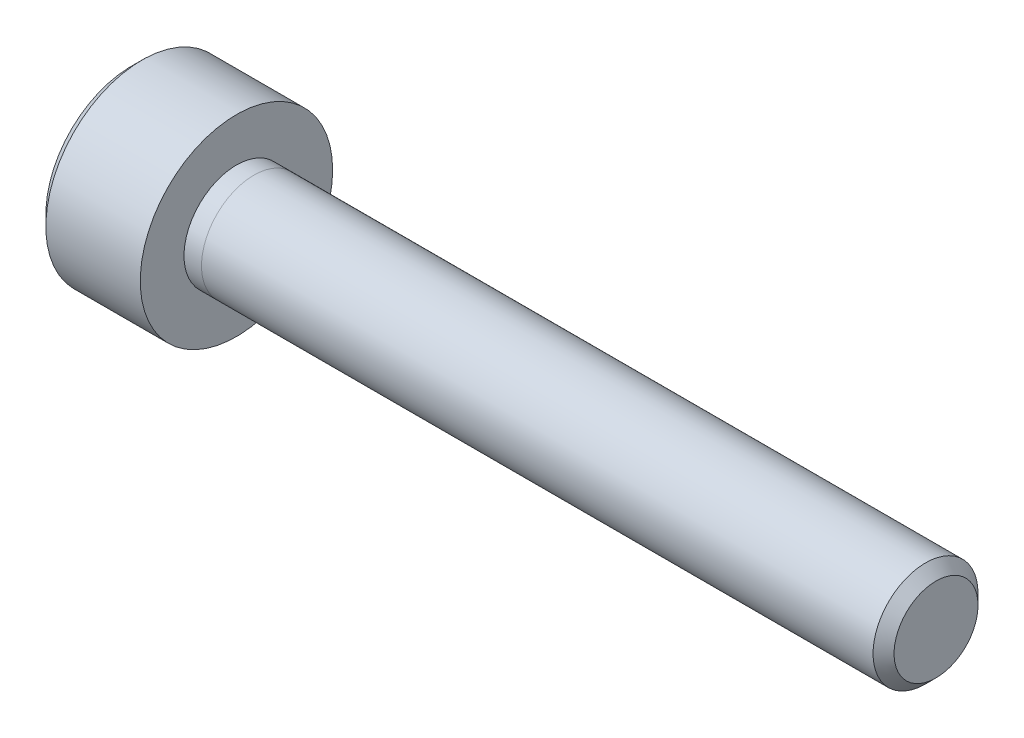
ISO-10303-21;
HEADER;
FILE_DESCRIPTION(('STEP AP214'),'2;1');
FILE_NAME('part.step','',(''),(''),'','','');
FILE_SCHEMA(('AUTOMOTIVE_DESIGN { 1 0 10303 214 1 1 1 1 }'));
ENDSEC;
DATA;
#1=APPLICATION_CONTEXT('core data for automotive mechanical design processes');
#2=APPLICATION_PROTOCOL_DEFINITION('international standard','automotive_design',2000,#1);
#3=PRODUCT_CONTEXT('',#1,'mechanical');
#4=PRODUCT('Part','Part','',(#3));
#5=PRODUCT_RELATED_PRODUCT_CATEGORY('part','',(#4));
#6=PRODUCT_DEFINITION_FORMATION('','',#4);
#7=PRODUCT_DEFINITION_CONTEXT('part definition',#1,'design');
#8=PRODUCT_DEFINITION('design','',#6,#7);
#9=PRODUCT_DEFINITION_SHAPE('','',#8);
#10=(LENGTH_UNIT() NAMED_UNIT(*) SI_UNIT(.MILLI.,.METRE.));
#11=(NAMED_UNIT(*) PLANE_ANGLE_UNIT() SI_UNIT($,.RADIAN.));
#12=(NAMED_UNIT(*) SI_UNIT($,.STERADIAN.) SOLID_ANGLE_UNIT());
#13=UNCERTAINTY_MEASURE_WITH_UNIT(LENGTH_MEASURE(1.E-05),#10,'distance_accuracy_value','');
#14=(GEOMETRIC_REPRESENTATION_CONTEXT(3) GLOBAL_UNCERTAINTY_ASSIGNED_CONTEXT((#13)) GLOBAL_UNIT_ASSIGNED_CONTEXT((#10,
#11,#12)) REPRESENTATION_CONTEXT('',''));
#15=CARTESIAN_POINT('',(0.,0.,0.));
#16=DIRECTION('',(0.,0.,1.));
#17=DIRECTION('',(1.,0.,0.));
#18=AXIS2_PLACEMENT_3D('',#15,#16,#17);
#19=CARTESIAN_POINT('',(23.,0.,0.));
#20=DIRECTION('',(-1.,0.,0.));
#21=DIRECTION('',(0.,0.,1.));
#22=AXIS2_PLACEMENT_3D('',#19,#20,#21);
#23=CYLINDRICAL_SURFACE('',#22,1.5);
#24=CARTESIAN_POINT('',(22.7,0.,0.));
#25=DIRECTION('',(1.,0.,0.));
#26=DIRECTION('',(0.,0.,-1.));
#27=AXIS2_PLACEMENT_3D('',#24,#25,#26);
#28=CIRCLE('',#27,1.5);
#29=CARTESIAN_POINT('',(22.7,0.,-1.5));
#30=VERTEX_POINT('',#29);
#31=EDGE_CURVE('E11',#30,#30,#28,.F.);
#32=ORIENTED_EDGE('',*,*,#31,.T.);
#33=EDGE_LOOP('',(#32));
#34=FACE_BOUND('',#33,.T.);
#35=CARTESIAN_POINT('',(3.5,0.,0.));
#36=DIRECTION('',(1.,0.,0.));
#37=DIRECTION('',(0.,0.,-1.));
#38=AXIS2_PLACEMENT_3D('',#35,#36,#37);
#39=CIRCLE('',#38,1.5);
#40=CARTESIAN_POINT('',(3.5,0.,-1.5));
#41=VERTEX_POINT('',#40);
#42=EDGE_CURVE('E64',#41,#41,#39,.T.);
#43=ORIENTED_EDGE('',*,*,#42,.T.);
#44=EDGE_LOOP('',(#43));
#45=FACE_BOUND('',#44,.T.);
#46=ADVANCED_FACE('F50',(#34,#45),#23,.T.);
#47=CARTESIAN_POINT('',(23.,0.,0.));
#48=DIRECTION('',(1.,0.,0.));
#49=DIRECTION('',(0.,0.,-1.));
#50=AXIS2_PLACEMENT_3D('',#47,#48,#49);
#51=PLANE('',#50);
#52=CARTESIAN_POINT('',(23.,0.,0.));
#53=DIRECTION('',(1.,0.,0.));
#54=DIRECTION('',(0.,0.,-1.));
#55=AXIS2_PLACEMENT_3D('',#52,#53,#54);
#56=CIRCLE('',#55,1.2);
#57=CARTESIAN_POINT('',(23.,0.,-1.2));
#58=VERTEX_POINT('',#57);
#59=EDGE_CURVE('E58',#58,#58,#56,.T.);
#60=ORIENTED_EDGE('',*,*,#59,.T.);
#61=EDGE_LOOP('',(#60));
#62=FACE_BOUND('',#61,.T.);
#63=ADVANCED_FACE('F74',(#62),#51,.T.);
#64=CARTESIAN_POINT('',(3.5,0.,0.));
#65=DIRECTION('',(1.,0.,0.));
#66=DIRECTION('',(0.,0.,-1.));
#67=AXIS2_PLACEMENT_3D('',#64,#65,#66);
#68=PLANE('',#67);
#69=ORIENTED_EDGE('',*,*,#42,.F.);
#70=EDGE_LOOP('',(#69));
#71=FACE_BOUND('',#70,.T.);
#72=ADVANCED_FACE('F72',(#71),#68,.F.);
#73=CARTESIAN_POINT('',(23.,0.,0.));
#74=DIRECTION('',(-1.,0.,0.));
#75=DIRECTION('',(0.,0.,1.));
#76=AXIS2_PLACEMENT_3D('',#73,#74,#75);
#77=CONICAL_SURFACE('',#76,1.2,0.785398163397452);
#78=ORIENTED_EDGE('',*,*,#31,.F.);
#79=EDGE_LOOP('',(#78));
#80=FACE_BOUND('',#79,.T.);
#81=ORIENTED_EDGE('',*,*,#59,.F.);
#82=EDGE_LOOP('',(#81));
#83=FACE_BOUND('',#82,.T.);
#84=ADVANCED_FACE('F52',(#80,#83),#77,.T.);
#85=CLOSED_SHELL('',(#46,#63,#72,#84));
#86=MANIFOLD_SOLID_BREP('B2',#85);
#87=CARTESIAN_POINT('',(3.,0.,0.));
#88=DIRECTION('',(1.,0.,0.));
#89=DIRECTION('',(0.,0.,-1.));
#90=AXIS2_PLACEMENT_3D('',#87,#88,#89);
#91=PLANE('',#90);
#92=CARTESIAN_POINT('',(3.,0.,0.));
#93=DIRECTION('',(1.,0.,0.));
#94=DIRECTION('',(0.,0.,-1.));
#95=AXIS2_PLACEMENT_3D('',#92,#93,#94);
#96=CIRCLE('',#95,2.75);
#97=CARTESIAN_POINT('',(3.,0.,-2.75));
#98=VERTEX_POINT('',#97);
#99=EDGE_CURVE('E243',#98,#98,#96,.T.);
#100=ORIENTED_EDGE('',*,*,#99,.T.);
#101=EDGE_LOOP('',(#100));
#102=FACE_BOUND('',#101,.T.);
#103=CARTESIAN_POINT('',(3.,0.,0.));
#104=DIRECTION('',(1.,0.,0.));
#105=DIRECTION('',(0.,0.,-1.));
#106=AXIS2_PLACEMENT_3D('',#103,#104,#105);
#107=CIRCLE('',#106,1.5);
#108=CARTESIAN_POINT('',(3.,0.,-1.5));
#109=VERTEX_POINT('',#108);
#110=EDGE_CURVE('E229',#109,#109,#107,.T.);
#111=ORIENTED_EDGE('',*,*,#110,.F.);
#112=EDGE_LOOP('',(#111));
#113=FACE_BOUND('',#112,.T.);
#114=ADVANCED_FACE('F114',(#102,#113),#91,.T.);
#115=CARTESIAN_POINT('',(3.,0.,0.));
#116=DIRECTION('',(-1.,0.,0.));
#117=DIRECTION('',(0.,0.,1.));
#118=AXIS2_PLACEMENT_3D('',#115,#116,#117);
#119=CYLINDRICAL_SURFACE('',#118,2.75);
#120=CARTESIAN_POINT('',(0.299999999999997,0.,0.));
#121=DIRECTION('',(1.,0.,0.));
#122=DIRECTION('',(0.,0.,-1.));
#123=AXIS2_PLACEMENT_3D('',#120,#121,#122);
#124=CIRCLE('',#123,2.75);
#125=CARTESIAN_POINT('',(0.299999999999997,0.,-2.75));
#126=VERTEX_POINT('',#125);
#127=EDGE_CURVE('E123',#126,#126,#124,.T.);
#128=ORIENTED_EDGE('',*,*,#127,.T.);
#129=EDGE_LOOP('',(#128));
#130=FACE_BOUND('',#129,.T.);
#131=ORIENTED_EDGE('',*,*,#99,.F.);
#132=EDGE_LOOP('',(#131));
#133=FACE_BOUND('',#132,.T.);
#134=ADVANCED_FACE('F253',(#130,#133),#119,.T.);
#135=CARTESIAN_POINT('',(0.,0.,0.));
#136=DIRECTION('',(1.,0.,0.));
#137=DIRECTION('',(0.,0.,-1.));
#138=AXIS2_PLACEMENT_3D('',#135,#136,#137);
#139=PLANE('',#138);
#140=DIRECTION('',(0.,0.792442347030254,-0.609946822791284));
#141=VECTOR('',#140,1.);
#142=CARTESIAN_POINT('',(0.,0.190537525520136,1.4307441367002));
#143=LINE('',#142,#141);
#144=CARTESIAN_POINT('',(0.,0.190537525520136,1.4307441367002));
#145=VERTEX_POINT('',#144);
#146=CARTESIAN_POINT('',(0.,1.33432953145808,0.550361730875436));
#147=VERTEX_POINT('',#146);
#148=EDGE_CURVE('E212',#145,#147,#143,.T.);
#149=ORIENTED_EDGE('',*,*,#148,.F.);
#150=DIRECTION('',(0.,0.924450617009985,0.381301792167121));
#151=VECTOR('',#150,1.);
#152=CARTESIAN_POINT('',(0.,-1.14379200593794,0.880382405824763));
#153=LINE('',#152,#151);
#154=CARTESIAN_POINT('',(0.,-1.14379200593794,0.880382405824763));
#155=VERTEX_POINT('',#154);
#156=EDGE_CURVE('E130',#155,#145,#153,.T.);
#157=ORIENTED_EDGE('',*,*,#156,.F.);
#158=DIRECTION('',(0.,0.132008269979731,0.991248614958406));
#159=VECTOR('',#158,1.);
#160=CARTESIAN_POINT('',(0.,-1.33432953145808,-0.550361730875436));
#161=LINE('',#160,#159);
#162=CARTESIAN_POINT('',(0.,-1.33432953145808,-0.550361730875436));
#163=VERTEX_POINT('',#162);
#164=EDGE_CURVE('E224',#163,#155,#161,.T.);
#165=ORIENTED_EDGE('',*,*,#164,.F.);
#166=DIRECTION('',(0.,-0.792442347030254,0.609946822791285));
#167=VECTOR('',#166,1.);
#168=CARTESIAN_POINT('',(0.,-0.190537525520136,-1.4307441367002));
#169=LINE('',#168,#167);
#170=CARTESIAN_POINT('',(0.,-0.190537525520136,-1.4307441367002));
#171=VERTEX_POINT('',#170);
#172=EDGE_CURVE('E221',#171,#163,#169,.T.);
#173=ORIENTED_EDGE('',*,*,#172,.F.);
#174=DIRECTION('',(0.,-0.924450617009985,-0.381301792167121));
#175=VECTOR('',#174,1.);
#176=CARTESIAN_POINT('',(0.,1.14379200593794,-0.880382405824763));
#177=LINE('',#176,#175);
#178=CARTESIAN_POINT('',(0.,1.14379200593794,-0.880382405824763));
#179=VERTEX_POINT('',#178);
#180=EDGE_CURVE('E178',#179,#171,#177,.T.);
#181=ORIENTED_EDGE('',*,*,#180,.F.);
#182=DIRECTION('',(0.,-0.132008269979731,-0.991248614958406));
#183=VECTOR('',#182,1.);
#184=CARTESIAN_POINT('',(0.,1.33432953145808,0.550361730875436));
#185=LINE('',#184,#183);
#186=EDGE_CURVE('E216',#147,#179,#185,.T.);
#187=ORIENTED_EDGE('',*,*,#186,.F.);
#188=EDGE_LOOP('',(#149,#157,#165,#173,#181,#187));
#189=FACE_BOUND('',#188,.T.);
#190=CARTESIAN_POINT('',(0.,0.,0.));
#191=DIRECTION('',(1.,0.,0.));
#192=DIRECTION('',(0.,0.,-1.));
#193=AXIS2_PLACEMENT_3D('',#190,#191,#192);
#194=CIRCLE('',#193,2.45);
#195=CARTESIAN_POINT('',(0.,0.,-2.45));
#196=VERTEX_POINT('',#195);
#197=EDGE_CURVE('E48',#196,#196,#194,.F.);
#198=ORIENTED_EDGE('',*,*,#197,.T.);
#199=EDGE_LOOP('',(#198));
#200=FACE_BOUND('',#199,.T.);
#201=ADVANCED_FACE('F276',(#189,#200),#139,.F.);
#202=CARTESIAN_POINT('',(3.5,0.,0.));
#203=DIRECTION('',(-1.,0.,0.));
#204=DIRECTION('',(0.,0.,1.));
#205=AXIS2_PLACEMENT_3D('',#202,#203,#204);
#206=CYLINDRICAL_SURFACE('',#205,1.5);
#207=CARTESIAN_POINT('',(3.5,0.,0.));
#208=DIRECTION('',(1.,0.,0.));
#209=DIRECTION('',(0.,0.,-1.));
#210=AXIS2_PLACEMENT_3D('',#207,#208,#209);
#211=CIRCLE('',#210,1.5);
#212=CARTESIAN_POINT('',(3.5,0.,-1.5));
#213=VERTEX_POINT('',#212);
#214=EDGE_CURVE('E239',#213,#213,#211,.T.);
#215=ORIENTED_EDGE('',*,*,#214,.F.);
#216=EDGE_LOOP('',(#215));
#217=FACE_BOUND('',#216,.T.);
#218=ORIENTED_EDGE('',*,*,#110,.T.);
#219=EDGE_LOOP('',(#218));
#220=FACE_BOUND('',#219,.T.);
#221=ADVANCED_FACE('F266',(#217,#220),#206,.T.);
#222=CARTESIAN_POINT('',(3.5,0.,0.));
#223=DIRECTION('',(1.,0.,0.));
#224=DIRECTION('',(0.,0.,-1.));
#225=AXIS2_PLACEMENT_3D('',#222,#223,#224);
#226=PLANE('',#225);
#227=ORIENTED_EDGE('',*,*,#214,.T.);
#228=EDGE_LOOP('',(#227));
#229=FACE_BOUND('',#228,.T.);
#230=ADVANCED_FACE('F258',(#229),#226,.T.);
#231=CARTESIAN_POINT('',(0.299999999999997,0.,0.));
#232=DIRECTION('',(1.,0.,0.));
#233=DIRECTION('',(0.,0.,-1.));
#234=AXIS2_PLACEMENT_3D('',#231,#232,#233);
#235=CONICAL_SURFACE('',#234,2.75,0.78539816339745);
#236=ORIENTED_EDGE('',*,*,#197,.F.);
#237=EDGE_LOOP('',(#236));
#238=FACE_BOUND('',#237,.T.);
#239=ORIENTED_EDGE('',*,*,#127,.F.);
#240=EDGE_LOOP('',(#239));
#241=FACE_BOUND('',#240,.T.);
#242=ADVANCED_FACE('F116',(#238,#241),#235,.T.);
#243=CARTESIAN_POINT('',(2.2,-1.14379200593794,0.880382405824763));
#244=DIRECTION('',(0.,-0.381301792167121,0.924450617009985));
#245=DIRECTION('',(0.,-0.924450617009985,-0.381301792167121));
#246=AXIS2_PLACEMENT_3D('',#243,#244,#245);
#247=PLANE('',#246);
#248=ORIENTED_EDGE('',*,*,#156,.T.);
#249=DIRECTION('',(-1.,0.,0.));
#250=VECTOR('',#249,1.);
#251=CARTESIAN_POINT('',(2.2,0.190537525520136,1.4307441367002));
#252=LINE('',#251,#250);
#253=CARTESIAN_POINT('',(2.2,0.190537525520136,1.4307441367002));
#254=VERTEX_POINT('',#253);
#255=EDGE_CURVE('E160',#254,#145,#252,.T.);
#256=ORIENTED_EDGE('',*,*,#255,.F.);
#257=DIRECTION('',(0.,0.924450617009985,0.381301792167121));
#258=VECTOR('',#257,1.);
#259=CARTESIAN_POINT('',(2.2,-1.14379200593794,0.880382405824763));
#260=LINE('',#259,#258);
#261=CARTESIAN_POINT('',(2.2,-1.14379200593794,0.880382405824763));
#262=VERTEX_POINT('',#261);
#263=EDGE_CURVE('E227',#262,#254,#260,.T.);
#264=ORIENTED_EDGE('',*,*,#263,.F.);
#265=DIRECTION('',(-1.,0.,0.));
#266=VECTOR('',#265,1.);
#267=CARTESIAN_POINT('',(2.2,-1.14379200593794,0.880382405824763));
#268=LINE('',#267,#266);
#269=EDGE_CURVE('E138',#262,#155,#268,.T.);
#270=ORIENTED_EDGE('',*,*,#269,.T.);
#271=EDGE_LOOP('',(#248,#256,#264,#270));
#272=FACE_BOUND('',#271,.T.);
#273=ADVANCED_FACE('F257',(#272),#247,.F.);
#274=CARTESIAN_POINT('',(2.2,-1.33432953145808,-0.550361730875436));
#275=DIRECTION('',(0.,-0.991248614958406,0.132008269979731));
#276=DIRECTION('',(0.,-0.132008269979731,-0.991248614958406));
#277=AXIS2_PLACEMENT_3D('',#274,#275,#276);
#278=PLANE('',#277);
#279=ORIENTED_EDGE('',*,*,#164,.T.);
#280=ORIENTED_EDGE('',*,*,#269,.F.);
#281=DIRECTION('',(0.,0.132008269979731,0.991248614958406));
#282=VECTOR('',#281,1.);
#283=CARTESIAN_POINT('',(2.2,-1.33432953145808,-0.550361730875436));
#284=LINE('',#283,#282);
#285=CARTESIAN_POINT('',(2.2,-1.33432953145808,-0.550361730875436));
#286=VERTEX_POINT('',#285);
#287=EDGE_CURVE('E192',#286,#262,#284,.T.);
#288=ORIENTED_EDGE('',*,*,#287,.F.);
#289=DIRECTION('',(-1.,0.,0.));
#290=VECTOR('',#289,1.);
#291=CARTESIAN_POINT('',(2.2,-1.33432953145808,-0.550361730875436));
#292=LINE('',#291,#290);
#293=EDGE_CURVE('E183',#286,#163,#292,.T.);
#294=ORIENTED_EDGE('',*,*,#293,.T.);
#295=EDGE_LOOP('',(#279,#280,#288,#294));
#296=FACE_BOUND('',#295,.T.);
#297=ADVANCED_FACE('F264',(#296),#278,.F.);
#298=CARTESIAN_POINT('',(2.2,-0.190537525520136,-1.4307441367002));
#299=DIRECTION('',(0.,-0.609946822791284,-0.792442347030254));
#300=DIRECTION('',(0.,0.792442347030254,-0.609946822791285));
#301=AXIS2_PLACEMENT_3D('',#298,#299,#300);
#302=PLANE('',#301);
#303=ORIENTED_EDGE('',*,*,#172,.T.);
#304=ORIENTED_EDGE('',*,*,#293,.F.);
#305=DIRECTION('',(0.,-0.792442347030254,0.609946822791285));
#306=VECTOR('',#305,1.);
#307=CARTESIAN_POINT('',(2.2,-0.190537525520136,-1.4307441367002));
#308=LINE('',#307,#306);
#309=CARTESIAN_POINT('',(2.2,-0.190537525520136,-1.4307441367002));
#310=VERTEX_POINT('',#309);
#311=EDGE_CURVE('E187',#310,#286,#308,.T.);
#312=ORIENTED_EDGE('',*,*,#311,.F.);
#313=DIRECTION('',(-1.,0.,0.));
#314=VECTOR('',#313,1.);
#315=CARTESIAN_POINT('',(2.2,-0.190537525520136,-1.4307441367002));
#316=LINE('',#315,#314);
#317=EDGE_CURVE('E171',#310,#171,#316,.T.);
#318=ORIENTED_EDGE('',*,*,#317,.T.);
#319=EDGE_LOOP('',(#303,#304,#312,#318));
#320=FACE_BOUND('',#319,.T.);
#321=ADVANCED_FACE('F188',(#320),#302,.F.);
#322=CARTESIAN_POINT('',(2.2,1.14379200593794,-0.880382405824763));
#323=DIRECTION('',(0.,0.381301792167121,-0.924450617009985));
#324=DIRECTION('',(0.,0.924450617009985,0.381301792167122));
#325=AXIS2_PLACEMENT_3D('',#322,#323,#324);
#326=PLANE('',#325);
#327=ORIENTED_EDGE('',*,*,#180,.T.);
#328=ORIENTED_EDGE('',*,*,#317,.F.);
#329=DIRECTION('',(0.,-0.924450617009985,-0.381301792167121));
#330=VECTOR('',#329,1.);
#331=CARTESIAN_POINT('',(2.2,1.14379200593794,-0.880382405824763));
#332=LINE('',#331,#330);
#333=CARTESIAN_POINT('',(2.2,1.14379200593794,-0.880382405824763));
#334=VERTEX_POINT('',#333);
#335=EDGE_CURVE('E175',#334,#310,#332,.T.);
#336=ORIENTED_EDGE('',*,*,#335,.F.);
#337=DIRECTION('',(-1.,0.,0.));
#338=VECTOR('',#337,1.);
#339=CARTESIAN_POINT('',(2.2,1.14379200593794,-0.880382405824763));
#340=LINE('',#339,#338);
#341=EDGE_CURVE('E184',#334,#179,#340,.T.);
#342=ORIENTED_EDGE('',*,*,#341,.T.);
#343=EDGE_LOOP('',(#327,#328,#336,#342));
#344=FACE_BOUND('',#343,.T.);
#345=ADVANCED_FACE('F173',(#344),#326,.F.);
#346=CARTESIAN_POINT('',(2.2,1.33432953145808,0.550361730875436));
#347=DIRECTION('',(0.,0.991248614958406,-0.132008269979731));
#348=DIRECTION('',(0.,0.132008269979731,0.991248614958406));
#349=AXIS2_PLACEMENT_3D('',#346,#347,#348);
#350=PLANE('',#349);
#351=ORIENTED_EDGE('',*,*,#186,.T.);
#352=ORIENTED_EDGE('',*,*,#341,.F.);
#353=DIRECTION('',(0.,-0.132008269979731,-0.991248614958406));
#354=VECTOR('',#353,1.);
#355=CARTESIAN_POINT('',(2.2,1.33432953145808,0.550361730875436));
#356=LINE('',#355,#354);
#357=CARTESIAN_POINT('',(2.2,1.33432953145808,0.550361730875436));
#358=VERTEX_POINT('',#357);
#359=EDGE_CURVE('E198',#358,#334,#356,.T.);
#360=ORIENTED_EDGE('',*,*,#359,.F.);
#361=DIRECTION('',(-1.,0.,0.));
#362=VECTOR('',#361,1.);
#363=CARTESIAN_POINT('',(2.2,1.33432953145808,0.550361730875436));
#364=LINE('',#363,#362);
#365=EDGE_CURVE('E234',#358,#147,#364,.T.);
#366=ORIENTED_EDGE('',*,*,#365,.T.);
#367=EDGE_LOOP('',(#351,#352,#360,#366));
#368=FACE_BOUND('',#367,.T.);
#369=ADVANCED_FACE('F305',(#368),#350,.F.);
#370=CARTESIAN_POINT('',(2.2,0.190537525520136,1.4307441367002));
#371=DIRECTION('',(0.,0.609946822791285,0.792442347030254));
#372=DIRECTION('',(0.,-0.792442347030254,0.609946822791285));
#373=AXIS2_PLACEMENT_3D('',#370,#371,#372);
#374=PLANE('',#373);
#375=ORIENTED_EDGE('',*,*,#148,.T.);
#376=ORIENTED_EDGE('',*,*,#365,.F.);
#377=DIRECTION('',(0.,0.792442347030254,-0.609946822791284));
#378=VECTOR('',#377,1.);
#379=CARTESIAN_POINT('',(2.2,0.190537525520136,1.4307441367002));
#380=LINE('',#379,#378);
#381=EDGE_CURVE('E204',#254,#358,#380,.T.);
#382=ORIENTED_EDGE('',*,*,#381,.F.);
#383=ORIENTED_EDGE('',*,*,#255,.T.);
#384=EDGE_LOOP('',(#375,#376,#382,#383));
#385=FACE_BOUND('',#384,.T.);
#386=ADVANCED_FACE('F291',(#385),#374,.F.);
#387=CARTESIAN_POINT('',(2.2,0.,0.));
#388=DIRECTION('',(-1.,0.,0.));
#389=DIRECTION('',(0.,0.,1.));
#390=AXIS2_PLACEMENT_3D('',#387,#388,#389);
#391=PLANE('',#390);
#392=ORIENTED_EDGE('',*,*,#263,.T.);
#393=ORIENTED_EDGE('',*,*,#381,.T.);
#394=ORIENTED_EDGE('',*,*,#359,.T.);
#395=ORIENTED_EDGE('',*,*,#335,.T.);
#396=ORIENTED_EDGE('',*,*,#311,.T.);
#397=ORIENTED_EDGE('',*,*,#287,.T.);
#398=EDGE_LOOP('',(#392,#393,#394,#395,#396,#397));
#399=FACE_BOUND('',#398,.T.);
#400=ADVANCED_FACE('F195',(#399),#391,.T.);
#401=CLOSED_SHELL('',(#114,#134,#201,#221,#230,#242,#273,#297,#321,#345,#369,#386,#400));
#402=MANIFOLD_SOLID_BREP('B6',#401);
#403=ADVANCED_BREP_SHAPE_REPRESENTATION('',(#18,#86,#402),#14);
#404=SHAPE_DEFINITION_REPRESENTATION(#9,#403);
ENDSEC;
END-ISO-10303-21;
